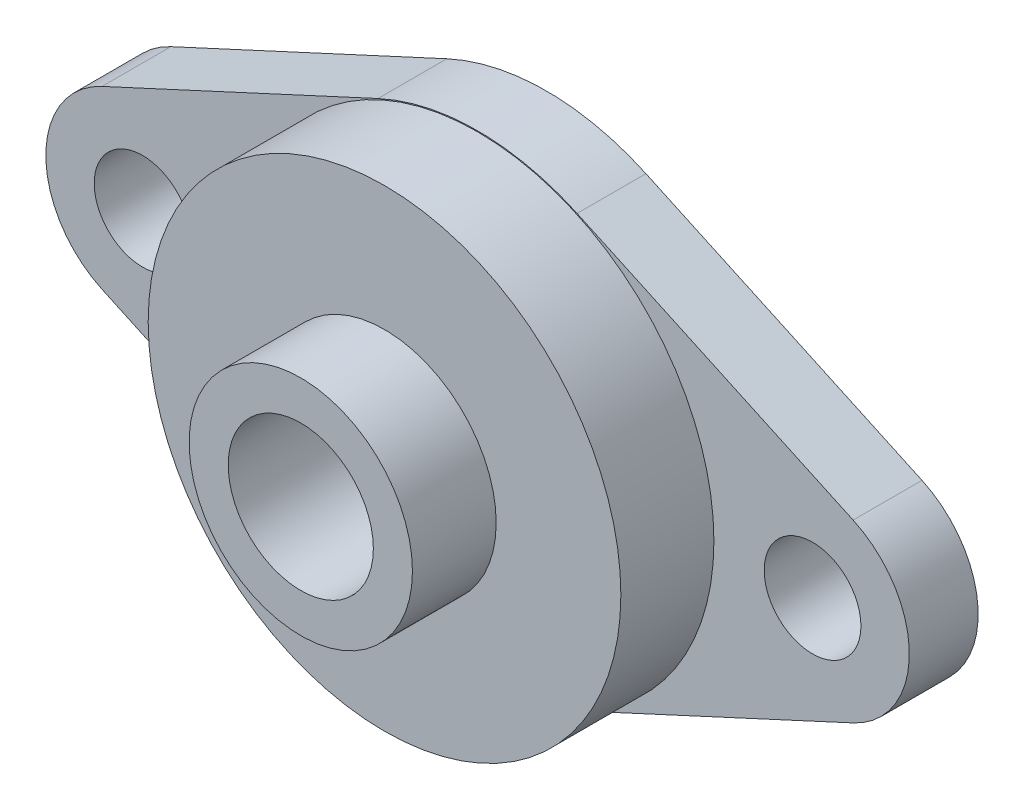
ISO-10303-21;
HEADER;
FILE_DESCRIPTION(('STEP AP214'),'2;1');
FILE_NAME('part.step','',(''),(''),'','','');
FILE_SCHEMA(('AUTOMOTIVE_DESIGN { 1 0 10303 214 1 1 1 1 }'));
ENDSEC;
DATA;
#1=APPLICATION_CONTEXT('core data for automotive mechanical design processes');
#2=APPLICATION_PROTOCOL_DEFINITION('international standard','automotive_design',2000,#1);
#3=PRODUCT_CONTEXT('',#1,'mechanical');
#4=PRODUCT('Part','Part','',(#3));
#5=PRODUCT_RELATED_PRODUCT_CATEGORY('part','',(#4));
#6=PRODUCT_DEFINITION_FORMATION('','',#4);
#7=PRODUCT_DEFINITION_CONTEXT('part definition',#1,'design');
#8=PRODUCT_DEFINITION('design','',#6,#7);
#9=PRODUCT_DEFINITION_SHAPE('','',#8);
#10=(LENGTH_UNIT() NAMED_UNIT(*) SI_UNIT(.MILLI.,.METRE.));
#11=(NAMED_UNIT(*) PLANE_ANGLE_UNIT() SI_UNIT($,.RADIAN.));
#12=(NAMED_UNIT(*) SI_UNIT($,.STERADIAN.) SOLID_ANGLE_UNIT());
#13=UNCERTAINTY_MEASURE_WITH_UNIT(LENGTH_MEASURE(1.E-05),#10,'distance_accuracy_value','');
#14=(GEOMETRIC_REPRESENTATION_CONTEXT(3) GLOBAL_UNCERTAINTY_ASSIGNED_CONTEXT((#13)) GLOBAL_UNIT_ASSIGNED_CONTEXT((#10,
#11,#12)) REPRESENTATION_CONTEXT('',''));
#15=CARTESIAN_POINT('',(0.,0.,0.));
#16=DIRECTION('',(0.,0.,1.));
#17=DIRECTION('',(1.,0.,0.));
#18=AXIS2_PLACEMENT_3D('',#15,#16,#17);
#19=CARTESIAN_POINT('',(0.,0.,8.7));
#20=DIRECTION('',(0.,0.,1.));
#21=DIRECTION('',(1.,0.,0.));
#22=AXIS2_PLACEMENT_3D('',#19,#20,#21);
#23=PLANE('',#22);
#24=CARTESIAN_POINT('',(0.,0.,8.7));
#25=DIRECTION('',(0.,0.,1.));
#26=DIRECTION('',(1.,0.,0.));
#27=AXIS2_PLACEMENT_3D('',#24,#25,#26);
#28=CIRCLE('',#27,12.7);
#29=CARTESIAN_POINT('',(12.7,0.,8.7));
#30=VERTEX_POINT('',#29);
#31=EDGE_CURVE('E198',#30,#30,#28,.T.);
#32=ORIENTED_EDGE('',*,*,#31,.T.);
#33=EDGE_LOOP('',(#32));
#34=FACE_BOUND('',#33,.T.);
#35=CARTESIAN_POINT('',(0.,0.,8.7));
#36=DIRECTION('',(0.,0.,1.));
#37=DIRECTION('',(1.,0.,0.));
#38=AXIS2_PLACEMENT_3D('',#35,#36,#37);
#39=CIRCLE('',#38,6.);
#40=CARTESIAN_POINT('',(6.,0.,8.7));
#41=VERTEX_POINT('',#40);
#42=EDGE_CURVE('E203',#41,#41,#39,.T.);
#43=ORIENTED_EDGE('',*,*,#42,.F.);
#44=EDGE_LOOP('',(#43));
#45=FACE_BOUND('',#44,.T.);
#46=ADVANCED_FACE('F33',(#34,#45),#23,.T.);
#47=CARTESIAN_POINT('',(0.,0.,3.7));
#48=DIRECTION('',(0.,0.,1.));
#49=DIRECTION('',(1.,0.,0.));
#50=AXIS2_PLACEMENT_3D('',#47,#48,#49);
#51=PLANE('',#50);
#52=CARTESIAN_POINT('',(0.,0.,3.7));
#53=DIRECTION('',(0.,0.,1.));
#54=DIRECTION('',(1.,0.,0.));
#55=AXIS2_PLACEMENT_3D('',#52,#53,#54);
#56=CIRCLE('',#55,12.7);
#57=CARTESIAN_POINT('',(12.7,0.,3.7));
#58=VERTEX_POINT('',#57);
#59=EDGE_CURVE('E11',#58,#58,#56,.T.);
#60=ORIENTED_EDGE('',*,*,#59,.F.);
#61=EDGE_LOOP('',(#60));
#62=FACE_BOUND('',#61,.T.);
#63=CARTESIAN_POINT('',(18.,0.,3.7));
#64=DIRECTION('',(0.,0.,1.));
#65=DIRECTION('',(1.,0.,0.));
#66=AXIS2_PLACEMENT_3D('',#63,#64,#65);
#67=CIRCLE('',#66,2.6);
#68=CARTESIAN_POINT('',(20.6,0.,3.7));
#69=VERTEX_POINT('',#68);
#70=EDGE_CURVE('E188',#69,#69,#67,.T.);
#71=ORIENTED_EDGE('',*,*,#70,.F.);
#72=EDGE_LOOP('',(#71));
#73=FACE_BOUND('',#72,.T.);
#74=CARTESIAN_POINT('',(0.,0.,3.7));
#75=DIRECTION('',(0.,0.,1.));
#76=DIRECTION('',(1.,0.,0.));
#77=AXIS2_PLACEMENT_3D('',#74,#75,#76);
#78=CIRCLE('',#77,12.7500000000001);
#79=CARTESIAN_POINT('',(5.34791666666856,11.5742078487632,3.7));
#80=VERTEX_POINT('',#79);
#81=CARTESIAN_POINT('',(-5.34791666666856,11.5742078487632,3.7));
#82=VERTEX_POINT('',#81);
#83=EDGE_CURVE('E148',#80,#82,#78,.T.);
#84=ORIENTED_EDGE('',*,*,#83,.T.);
#85=DIRECTION('',(-0.907781007746131,-0.419444444444576,0.));
#86=VECTOR('',#85,1.);
#87=CARTESIAN_POINT('',(-20.1811061343986,4.72046353979092,3.7));
#88=LINE('',#87,#86);
#89=CARTESIAN_POINT('',(-20.1811061343986,4.72046353979092,3.7));
#90=VERTEX_POINT('',#89);
#91=EDGE_CURVE('E95',#82,#90,#88,.T.);
#92=ORIENTED_EDGE('',*,*,#91,.T.);
#93=CARTESIAN_POINT('',(-18.,0.,3.7));
#94=DIRECTION('',(0.,0.,1.));
#95=DIRECTION('',(1.,0.,0.));
#96=AXIS2_PLACEMENT_3D('',#93,#94,#95);
#97=CIRCLE('',#96,5.20000000000049);
#98=CARTESIAN_POINT('',(-20.1811061343986,-4.72046353979075,3.7));
#99=VERTEX_POINT('',#98);
#100=EDGE_CURVE('E179',#90,#99,#97,.T.);
#101=ORIENTED_EDGE('',*,*,#100,.T.);
#102=DIRECTION('',(0.907781007746124,-0.419444444444591,0.));
#103=VECTOR('',#102,1.);
#104=CARTESIAN_POINT('',(-20.1811061343985,-4.72046353979064,3.7));
#105=LINE('',#104,#103);
#106=CARTESIAN_POINT('',(-5.34791666666856,-11.5742078487632,3.7));
#107=VERTEX_POINT('',#106);
#108=EDGE_CURVE('E178',#99,#107,#105,.T.);
#109=ORIENTED_EDGE('',*,*,#108,.T.);
#110=CARTESIAN_POINT('',(0.,0.,3.7));
#111=DIRECTION('',(0.,0.,1.));
#112=DIRECTION('',(1.,0.,0.));
#113=AXIS2_PLACEMENT_3D('',#110,#111,#112);
#114=CIRCLE('',#113,12.7500000000001);
#115=CARTESIAN_POINT('',(5.34791666666856,-11.5742078487632,3.7));
#116=VERTEX_POINT('',#115);
#117=EDGE_CURVE('E115',#107,#116,#114,.T.);
#118=ORIENTED_EDGE('',*,*,#117,.T.);
#119=DIRECTION('',(0.907781007746131,0.419444444444576,0.));
#120=VECTOR('',#119,1.);
#121=CARTESIAN_POINT('',(20.1811061343986,-4.72046353979092,3.7));
#122=LINE('',#121,#120);
#123=CARTESIAN_POINT('',(20.1811061343986,-4.72046353979092,3.7));
#124=VERTEX_POINT('',#123);
#125=EDGE_CURVE('E108',#116,#124,#122,.T.);
#126=ORIENTED_EDGE('',*,*,#125,.T.);
#127=CARTESIAN_POINT('',(18.,0.,3.7));
#128=DIRECTION('',(0.,0.,1.));
#129=DIRECTION('',(1.,0.,0.));
#130=AXIS2_PLACEMENT_3D('',#127,#128,#129);
#131=CIRCLE('',#130,5.20000000000062);
#132=CARTESIAN_POINT('',(20.1811061343986,4.72046353979092,3.7));
#133=VERTEX_POINT('',#132);
#134=EDGE_CURVE('E113',#124,#133,#131,.T.);
#135=ORIENTED_EDGE('',*,*,#134,.T.);
#136=DIRECTION('',(-0.907781007746131,0.419444444444576,0.));
#137=VECTOR('',#136,1.);
#138=CARTESIAN_POINT('',(20.1811061343986,4.72046353979092,3.7));
#139=LINE('',#138,#137);
#140=EDGE_CURVE('E51',#133,#80,#139,.T.);
#141=ORIENTED_EDGE('',*,*,#140,.T.);
#142=EDGE_LOOP('',(#84,#92,#101,#109,#118,#126,#135,#141));
#143=FACE_BOUND('',#142,.T.);
#144=CARTESIAN_POINT('',(-18.,0.,3.7));
#145=DIRECTION('',(0.,0.,1.));
#146=DIRECTION('',(1.,0.,0.));
#147=AXIS2_PLACEMENT_3D('',#144,#145,#146);
#148=CIRCLE('',#147,2.6);
#149=CARTESIAN_POINT('',(-15.4,0.,3.7));
#150=VERTEX_POINT('',#149);
#151=EDGE_CURVE('E137',#150,#150,#148,.T.);
#152=ORIENTED_EDGE('',*,*,#151,.F.);
#153=EDGE_LOOP('',(#152));
#154=FACE_BOUND('',#153,.T.);
#155=ADVANCED_FACE('F110',(#62,#73,#143,#154),#51,.T.);
#156=CARTESIAN_POINT('',(0.,0.,0.));
#157=DIRECTION('',(0.,0.,1.));
#158=DIRECTION('',(1.,0.,0.));
#159=AXIS2_PLACEMENT_3D('',#156,#157,#158);
#160=PLANE('',#159);
#161=CARTESIAN_POINT('',(0.,0.,0.));
#162=DIRECTION('',(0.,0.,1.));
#163=DIRECTION('',(1.,0.,0.));
#164=AXIS2_PLACEMENT_3D('',#161,#162,#163);
#165=CIRCLE('',#164,12.7500000000001);
#166=CARTESIAN_POINT('',(5.34791666666856,11.5742078487632,0.));
#167=VERTEX_POINT('',#166);
#168=CARTESIAN_POINT('',(-5.34791666666856,11.5742078487632,0.));
#169=VERTEX_POINT('',#168);
#170=EDGE_CURVE('E133',#167,#169,#165,.T.);
#171=ORIENTED_EDGE('',*,*,#170,.F.);
#172=DIRECTION('',(-0.907781007746131,0.419444444444576,0.));
#173=VECTOR('',#172,1.);
#174=CARTESIAN_POINT('',(20.1811061343986,4.72046353979092,0.));
#175=LINE('',#174,#173);
#176=CARTESIAN_POINT('',(20.1811061343986,4.72046353979092,0.));
#177=VERTEX_POINT('',#176);
#178=EDGE_CURVE('E86',#177,#167,#175,.T.);
#179=ORIENTED_EDGE('',*,*,#178,.F.);
#180=CARTESIAN_POINT('',(18.,0.,0.));
#181=DIRECTION('',(0.,0.,1.));
#182=DIRECTION('',(1.,0.,0.));
#183=AXIS2_PLACEMENT_3D('',#180,#181,#182);
#184=CIRCLE('',#183,5.20000000000062);
#185=CARTESIAN_POINT('',(20.1811061343986,-4.72046353979092,0.));
#186=VERTEX_POINT('',#185);
#187=EDGE_CURVE('E80',#186,#177,#184,.T.);
#188=ORIENTED_EDGE('',*,*,#187,.F.);
#189=DIRECTION('',(0.907781007746131,0.419444444444576,0.));
#190=VECTOR('',#189,1.);
#191=CARTESIAN_POINT('',(20.1811061343986,-4.72046353979092,0.));
#192=LINE('',#191,#190);
#193=CARTESIAN_POINT('',(5.34791666666856,-11.5742078487632,0.));
#194=VERTEX_POINT('',#193);
#195=EDGE_CURVE('E123',#194,#186,#192,.T.);
#196=ORIENTED_EDGE('',*,*,#195,.F.);
#197=CARTESIAN_POINT('',(0.,0.,0.));
#198=DIRECTION('',(0.,0.,1.));
#199=DIRECTION('',(1.,0.,0.));
#200=AXIS2_PLACEMENT_3D('',#197,#198,#199);
#201=CIRCLE('',#200,12.7500000000001);
#202=CARTESIAN_POINT('',(-5.34791666666856,-11.5742078487632,0.));
#203=VERTEX_POINT('',#202);
#204=EDGE_CURVE('E143',#203,#194,#201,.T.);
#205=ORIENTED_EDGE('',*,*,#204,.F.);
#206=DIRECTION('',(0.907781007746124,-0.419444444444591,0.));
#207=VECTOR('',#206,1.);
#208=CARTESIAN_POINT('',(-20.1811061343985,-4.72046353979064,0.));
#209=LINE('',#208,#207);
#210=CARTESIAN_POINT('',(-20.1811061343986,-4.72046353979075,0.));
#211=VERTEX_POINT('',#210);
#212=EDGE_CURVE('E141',#211,#203,#209,.T.);
#213=ORIENTED_EDGE('',*,*,#212,.F.);
#214=CARTESIAN_POINT('',(-18.,0.,0.));
#215=DIRECTION('',(0.,0.,1.));
#216=DIRECTION('',(1.,0.,0.));
#217=AXIS2_PLACEMENT_3D('',#214,#215,#216);
#218=CIRCLE('',#217,5.20000000000049);
#219=CARTESIAN_POINT('',(-20.1811061343986,4.72046353979092,0.));
#220=VERTEX_POINT('',#219);
#221=EDGE_CURVE('E139',#220,#211,#218,.T.);
#222=ORIENTED_EDGE('',*,*,#221,.F.);
#223=DIRECTION('',(-0.907781007746131,-0.419444444444576,0.));
#224=VECTOR('',#223,1.);
#225=CARTESIAN_POINT('',(-20.1811061343986,4.72046353979092,0.));
#226=LINE('',#225,#224);
#227=EDGE_CURVE('E136',#169,#220,#226,.T.);
#228=ORIENTED_EDGE('',*,*,#227,.F.);
#229=EDGE_LOOP('',(#171,#179,#188,#196,#205,#213,#222,#228));
#230=FACE_BOUND('',#229,.T.);
#231=CARTESIAN_POINT('',(-18.,0.,0.));
#232=DIRECTION('',(0.,0.,1.));
#233=DIRECTION('',(1.,0.,0.));
#234=AXIS2_PLACEMENT_3D('',#231,#232,#233);
#235=CIRCLE('',#234,2.6);
#236=CARTESIAN_POINT('',(-15.4,0.,0.));
#237=VERTEX_POINT('',#236);
#238=EDGE_CURVE('E185',#237,#237,#235,.T.);
#239=ORIENTED_EDGE('',*,*,#238,.T.);
#240=EDGE_LOOP('',(#239));
#241=FACE_BOUND('',#240,.T.);
#242=CARTESIAN_POINT('',(18.,0.,0.));
#243=DIRECTION('',(0.,0.,1.));
#244=DIRECTION('',(1.,0.,0.));
#245=AXIS2_PLACEMENT_3D('',#242,#243,#244);
#246=CIRCLE('',#245,2.6);
#247=CARTESIAN_POINT('',(20.6,0.,0.));
#248=VERTEX_POINT('',#247);
#249=EDGE_CURVE('E191',#248,#248,#246,.T.);
#250=ORIENTED_EDGE('',*,*,#249,.T.);
#251=EDGE_LOOP('',(#250));
#252=FACE_BOUND('',#251,.T.);
#253=CARTESIAN_POINT('',(0.,0.,0.));
#254=DIRECTION('',(0.,0.,1.));
#255=DIRECTION('',(1.,0.,0.));
#256=AXIS2_PLACEMENT_3D('',#253,#254,#255);
#257=CIRCLE('',#256,3.9);
#258=CARTESIAN_POINT('',(3.9,0.,0.));
#259=VERTEX_POINT('',#258);
#260=EDGE_CURVE('E194',#259,#259,#257,.T.);
#261=ORIENTED_EDGE('',*,*,#260,.T.);
#262=EDGE_LOOP('',(#261));
#263=FACE_BOUND('',#262,.T.);
#264=ADVANCED_FACE('F168',(#230,#241,#252,#263),#160,.F.);
#265=CARTESIAN_POINT('',(0.,0.,3.7));
#266=DIRECTION('',(0.,0.,-1.));
#267=DIRECTION('',(-1.,0.,0.));
#268=AXIS2_PLACEMENT_3D('',#265,#266,#267);
#269=CYLINDRICAL_SURFACE('',#268,12.7500000000001);
#270=ORIENTED_EDGE('',*,*,#170,.T.);
#271=DIRECTION('',(0.,0.,-1.));
#272=VECTOR('',#271,1.);
#273=CARTESIAN_POINT('',(-5.34791666666856,11.5742078487632,3.7));
#274=LINE('',#273,#272);
#275=EDGE_CURVE('E37',#82,#169,#274,.T.);
#276=ORIENTED_EDGE('',*,*,#275,.F.);
#277=ORIENTED_EDGE('',*,*,#83,.F.);
#278=DIRECTION('',(0.,0.,-1.));
#279=VECTOR('',#278,1.);
#280=CARTESIAN_POINT('',(5.34791666666856,11.5742078487632,3.7));
#281=LINE('',#280,#279);
#282=EDGE_CURVE('E129',#80,#167,#281,.T.);
#283=ORIENTED_EDGE('',*,*,#282,.T.);
#284=EDGE_LOOP('',(#270,#276,#277,#283));
#285=FACE_BOUND('',#284,.T.);
#286=ADVANCED_FACE('F35',(#285),#269,.T.);
#287=CARTESIAN_POINT('',(-20.1811061343986,4.72046353979092,3.7));
#288=DIRECTION('',(0.419444444444576,-0.907781007746131,0.));
#289=DIRECTION('',(0.907781007746131,0.419444444444576,0.));
#290=AXIS2_PLACEMENT_3D('',#287,#288,#289);
#291=PLANE('',#290);
#292=ORIENTED_EDGE('',*,*,#227,.T.);
#293=DIRECTION('',(0.,0.,-1.));
#294=VECTOR('',#293,1.);
#295=CARTESIAN_POINT('',(-20.1811061343986,4.72046353979092,3.7));
#296=LINE('',#295,#294);
#297=EDGE_CURVE('E157',#90,#220,#296,.T.);
#298=ORIENTED_EDGE('',*,*,#297,.F.);
#299=ORIENTED_EDGE('',*,*,#91,.F.);
#300=ORIENTED_EDGE('',*,*,#275,.T.);
#301=EDGE_LOOP('',(#292,#298,#299,#300));
#302=FACE_BOUND('',#301,.T.);
#303=ADVANCED_FACE('F163',(#302),#291,.F.);
#304=CARTESIAN_POINT('',(-18.,0.,3.7));
#305=DIRECTION('',(0.,0.,-1.));
#306=DIRECTION('',(-1.,0.,0.));
#307=AXIS2_PLACEMENT_3D('',#304,#305,#306);
#308=CYLINDRICAL_SURFACE('',#307,5.20000000000049);
#309=ORIENTED_EDGE('',*,*,#221,.T.);
#310=DIRECTION('',(0.,0.,-1.));
#311=VECTOR('',#310,1.);
#312=CARTESIAN_POINT('',(-20.1811061343986,-4.72046353979075,3.7));
#313=LINE('',#312,#311);
#314=EDGE_CURVE('E155',#99,#211,#313,.T.);
#315=ORIENTED_EDGE('',*,*,#314,.F.);
#316=ORIENTED_EDGE('',*,*,#100,.F.);
#317=ORIENTED_EDGE('',*,*,#297,.T.);
#318=EDGE_LOOP('',(#309,#315,#316,#317));
#319=FACE_BOUND('',#318,.T.);
#320=ADVANCED_FACE('F173',(#319),#308,.T.);
#321=CARTESIAN_POINT('',(-20.1811061343985,-4.72046353979064,3.7));
#322=DIRECTION('',(0.419444444444591,0.907781007746124,0.));
#323=DIRECTION('',(-0.907781007746124,0.419444444444591,0.));
#324=AXIS2_PLACEMENT_3D('',#321,#322,#323);
#325=PLANE('',#324);
#326=ORIENTED_EDGE('',*,*,#212,.T.);
#327=DIRECTION('',(0.,0.,-1.));
#328=VECTOR('',#327,1.);
#329=CARTESIAN_POINT('',(-5.34791666666856,-11.5742078487632,3.7));
#330=LINE('',#329,#328);
#331=EDGE_CURVE('E152',#107,#203,#330,.T.);
#332=ORIENTED_EDGE('',*,*,#331,.F.);
#333=ORIENTED_EDGE('',*,*,#108,.F.);
#334=ORIENTED_EDGE('',*,*,#314,.T.);
#335=EDGE_LOOP('',(#326,#332,#333,#334));
#336=FACE_BOUND('',#335,.T.);
#337=ADVANCED_FACE('F176',(#336),#325,.F.);
#338=CARTESIAN_POINT('',(0.,0.,3.7));
#339=DIRECTION('',(0.,0.,-1.));
#340=DIRECTION('',(-1.,0.,0.));
#341=AXIS2_PLACEMENT_3D('',#338,#339,#340);
#342=CYLINDRICAL_SURFACE('',#341,12.7500000000001);
#343=ORIENTED_EDGE('',*,*,#204,.T.);
#344=DIRECTION('',(0.,0.,-1.));
#345=VECTOR('',#344,1.);
#346=CARTESIAN_POINT('',(5.34791666666856,-11.5742078487632,3.7));
#347=LINE('',#346,#345);
#348=EDGE_CURVE('E124',#116,#194,#347,.T.);
#349=ORIENTED_EDGE('',*,*,#348,.F.);
#350=ORIENTED_EDGE('',*,*,#117,.F.);
#351=ORIENTED_EDGE('',*,*,#331,.T.);
#352=EDGE_LOOP('',(#343,#349,#350,#351));
#353=FACE_BOUND('',#352,.T.);
#354=ADVANCED_FACE('F258',(#353),#342,.T.);
#355=CARTESIAN_POINT('',(20.1811061343986,-4.72046353979092,3.7));
#356=DIRECTION('',(-0.419444444444576,0.907781007746131,0.));
#357=DIRECTION('',(-0.907781007746131,-0.419444444444576,0.));
#358=AXIS2_PLACEMENT_3D('',#355,#356,#357);
#359=PLANE('',#358);
#360=ORIENTED_EDGE('',*,*,#195,.T.);
#361=DIRECTION('',(0.,0.,-1.));
#362=VECTOR('',#361,1.);
#363=CARTESIAN_POINT('',(20.1811061343986,-4.72046353979092,3.7));
#364=LINE('',#363,#362);
#365=EDGE_CURVE('E120',#124,#186,#364,.T.);
#366=ORIENTED_EDGE('',*,*,#365,.F.);
#367=ORIENTED_EDGE('',*,*,#125,.F.);
#368=ORIENTED_EDGE('',*,*,#348,.T.);
#369=EDGE_LOOP('',(#360,#366,#367,#368));
#370=FACE_BOUND('',#369,.T.);
#371=ADVANCED_FACE('F121',(#370),#359,.F.);
#372=CARTESIAN_POINT('',(18.,0.,3.7));
#373=DIRECTION('',(0.,0.,-1.));
#374=DIRECTION('',(-1.,0.,0.));
#375=AXIS2_PLACEMENT_3D('',#372,#373,#374);
#376=CYLINDRICAL_SURFACE('',#375,5.20000000000062);
#377=ORIENTED_EDGE('',*,*,#187,.T.);
#378=DIRECTION('',(0.,0.,-1.));
#379=VECTOR('',#378,1.);
#380=CARTESIAN_POINT('',(20.1811061343986,4.72046353979092,3.7));
#381=LINE('',#380,#379);
#382=EDGE_CURVE('E125',#133,#177,#381,.T.);
#383=ORIENTED_EDGE('',*,*,#382,.F.);
#384=ORIENTED_EDGE('',*,*,#134,.F.);
#385=ORIENTED_EDGE('',*,*,#365,.T.);
#386=EDGE_LOOP('',(#377,#383,#384,#385));
#387=FACE_BOUND('',#386,.T.);
#388=ADVANCED_FACE('F127',(#387),#376,.T.);
#389=CARTESIAN_POINT('',(20.1811061343986,4.72046353979092,3.7));
#390=DIRECTION('',(-0.419444444444576,-0.907781007746131,0.));
#391=DIRECTION('',(0.907781007746131,-0.419444444444576,0.));
#392=AXIS2_PLACEMENT_3D('',#389,#390,#391);
#393=PLANE('',#392);
#394=ORIENTED_EDGE('',*,*,#178,.T.);
#395=ORIENTED_EDGE('',*,*,#282,.F.);
#396=ORIENTED_EDGE('',*,*,#140,.F.);
#397=ORIENTED_EDGE('',*,*,#382,.T.);
#398=EDGE_LOOP('',(#394,#395,#396,#397));
#399=FACE_BOUND('',#398,.T.);
#400=ADVANCED_FACE('F247',(#399),#393,.F.);
#401=CARTESIAN_POINT('',(-18.,0.,3.7));
#402=DIRECTION('',(0.,0.,-1.));
#403=DIRECTION('',(-1.,0.,0.));
#404=AXIS2_PLACEMENT_3D('',#401,#402,#403);
#405=CYLINDRICAL_SURFACE('',#404,2.6);
#406=ORIENTED_EDGE('',*,*,#151,.T.);
#407=EDGE_LOOP('',(#406));
#408=FACE_BOUND('',#407,.T.);
#409=ORIENTED_EDGE('',*,*,#238,.F.);
#410=EDGE_LOOP('',(#409));
#411=FACE_BOUND('',#410,.T.);
#412=ADVANCED_FACE('F244',(#408,#411),#405,.F.);
#413=CARTESIAN_POINT('',(18.,0.,3.7));
#414=DIRECTION('',(0.,0.,-1.));
#415=DIRECTION('',(-1.,0.,0.));
#416=AXIS2_PLACEMENT_3D('',#413,#414,#415);
#417=CYLINDRICAL_SURFACE('',#416,2.6);
#418=ORIENTED_EDGE('',*,*,#70,.T.);
#419=EDGE_LOOP('',(#418));
#420=FACE_BOUND('',#419,.T.);
#421=ORIENTED_EDGE('',*,*,#249,.F.);
#422=EDGE_LOOP('',(#421));
#423=FACE_BOUND('',#422,.T.);
#424=ADVANCED_FACE('F240',(#420,#423),#417,.F.);
#425=CARTESIAN_POINT('',(0.,0.,3.7));
#426=DIRECTION('',(0.,0.,-1.));
#427=DIRECTION('',(-1.,0.,0.));
#428=AXIS2_PLACEMENT_3D('',#425,#426,#427);
#429=CYLINDRICAL_SURFACE('',#428,3.9);
#430=ORIENTED_EDGE('',*,*,#260,.F.);
#431=EDGE_LOOP('',(#430));
#432=FACE_BOUND('',#431,.T.);
#433=CARTESIAN_POINT('',(0.,0.,13.2));
#434=DIRECTION('',(0.,0.,1.));
#435=DIRECTION('',(1.,0.,0.));
#436=AXIS2_PLACEMENT_3D('',#433,#434,#435);
#437=CIRCLE('',#436,3.9);
#438=CARTESIAN_POINT('',(3.9,0.,13.2));
#439=VERTEX_POINT('',#438);
#440=EDGE_CURVE('E206',#439,#439,#437,.T.);
#441=ORIENTED_EDGE('',*,*,#440,.T.);
#442=EDGE_LOOP('',(#441));
#443=FACE_BOUND('',#442,.T.);
#444=ADVANCED_FACE('F212',(#432,#443),#429,.F.);
#445=CARTESIAN_POINT('',(0.,0.,8.7));
#446=DIRECTION('',(0.,0.,-1.));
#447=DIRECTION('',(-1.,0.,0.));
#448=AXIS2_PLACEMENT_3D('',#445,#446,#447);
#449=CYLINDRICAL_SURFACE('',#448,12.7);
#450=ORIENTED_EDGE('',*,*,#31,.F.);
#451=EDGE_LOOP('',(#450));
#452=FACE_BOUND('',#451,.T.);
#453=ORIENTED_EDGE('',*,*,#59,.T.);
#454=EDGE_LOOP('',(#453));
#455=FACE_BOUND('',#454,.T.);
#456=ADVANCED_FACE('F217',(#452,#455),#449,.T.);
#457=CARTESIAN_POINT('',(0.,0.,13.2));
#458=DIRECTION('',(0.,0.,1.));
#459=DIRECTION('',(1.,0.,0.));
#460=AXIS2_PLACEMENT_3D('',#457,#458,#459);
#461=PLANE('',#460);
#462=CARTESIAN_POINT('',(0.,0.,13.2));
#463=DIRECTION('',(0.,0.,1.));
#464=DIRECTION('',(1.,0.,0.));
#465=AXIS2_PLACEMENT_3D('',#462,#463,#464);
#466=CIRCLE('',#465,6.);
#467=CARTESIAN_POINT('',(6.,0.,13.2));
#468=VERTEX_POINT('',#467);
#469=EDGE_CURVE('E202',#468,#468,#466,.T.);
#470=ORIENTED_EDGE('',*,*,#469,.T.);
#471=EDGE_LOOP('',(#470));
#472=FACE_BOUND('',#471,.T.);
#473=ORIENTED_EDGE('',*,*,#440,.F.);
#474=EDGE_LOOP('',(#473));
#475=FACE_BOUND('',#474,.T.);
#476=ADVANCED_FACE('F214',(#472,#475),#461,.T.);
#477=CARTESIAN_POINT('',(0.,0.,13.2));
#478=DIRECTION('',(0.,0.,-1.));
#479=DIRECTION('',(-1.,0.,0.));
#480=AXIS2_PLACEMENT_3D('',#477,#478,#479);
#481=CYLINDRICAL_SURFACE('',#480,6.);
#482=ORIENTED_EDGE('',*,*,#469,.F.);
#483=EDGE_LOOP('',(#482));
#484=FACE_BOUND('',#483,.T.);
#485=ORIENTED_EDGE('',*,*,#42,.T.);
#486=EDGE_LOOP('',(#485));
#487=FACE_BOUND('',#486,.T.);
#488=ADVANCED_FACE('F216',(#484,#487),#481,.T.);
#489=CLOSED_SHELL('',(#46,#155,#264,#286,#303,#320,#337,#354,#371,#388,#400,#412,#424,#444,#456,
#476,#488));
#490=MANIFOLD_SOLID_BREP('B2',#489);
#491=ADVANCED_BREP_SHAPE_REPRESENTATION('',(#18,#490),#14);
#492=SHAPE_DEFINITION_REPRESENTATION(#9,#491);
ENDSEC;
END-ISO-10303-21;
